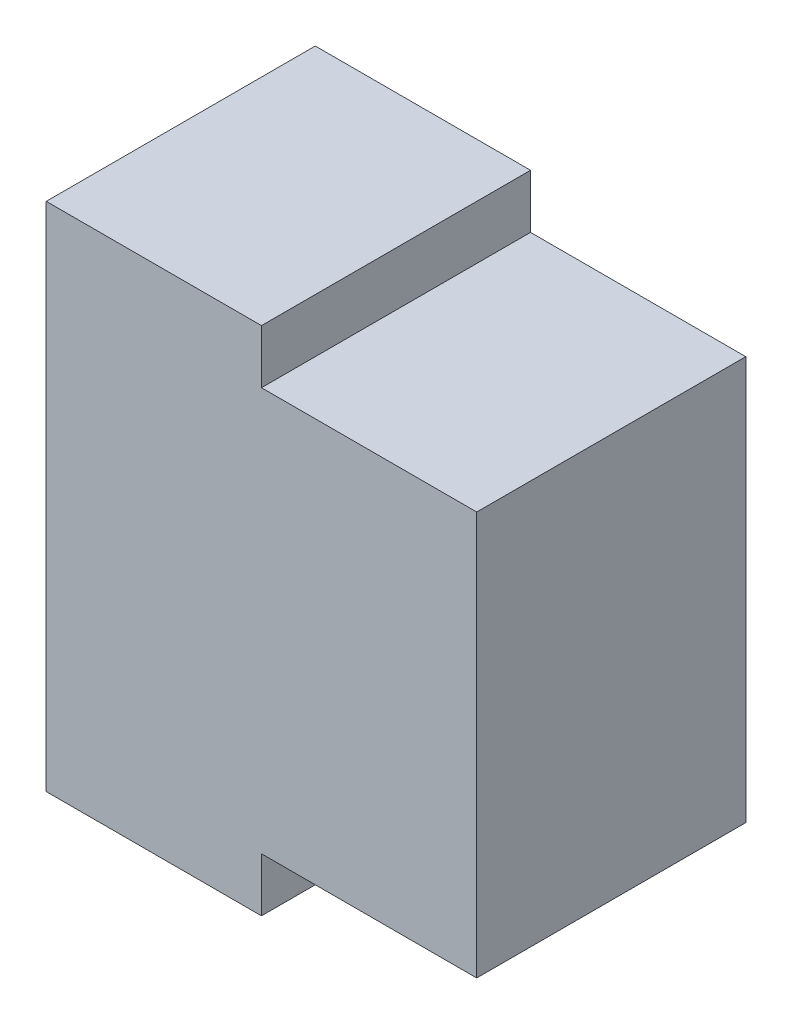
ISO-10303-21;
HEADER;
FILE_DESCRIPTION(('STEP AP214'),'2;1');
FILE_NAME('part.step','',(''),(''),'','','');
FILE_SCHEMA(('AUTOMOTIVE_DESIGN { 1 0 10303 214 1 1 1 1 }'));
ENDSEC;
DATA;
#1=APPLICATION_CONTEXT('core data for automotive mechanical design processes');
#2=APPLICATION_PROTOCOL_DEFINITION('international standard','automotive_design',2000,#1);
#3=PRODUCT_CONTEXT('',#1,'mechanical');
#4=PRODUCT('Part','Part','',(#3));
#5=PRODUCT_RELATED_PRODUCT_CATEGORY('part','',(#4));
#6=PRODUCT_DEFINITION_FORMATION('','',#4);
#7=PRODUCT_DEFINITION_CONTEXT('part definition',#1,'design');
#8=PRODUCT_DEFINITION('design','',#6,#7);
#9=PRODUCT_DEFINITION_SHAPE('','',#8);
#10=(LENGTH_UNIT() NAMED_UNIT(*) SI_UNIT(.MILLI.,.METRE.));
#11=(NAMED_UNIT(*) PLANE_ANGLE_UNIT() SI_UNIT($,.RADIAN.));
#12=(NAMED_UNIT(*) SI_UNIT($,.STERADIAN.) SOLID_ANGLE_UNIT());
#13=UNCERTAINTY_MEASURE_WITH_UNIT(LENGTH_MEASURE(1.E-05),#10,'distance_accuracy_value','');
#14=(GEOMETRIC_REPRESENTATION_CONTEXT(3) GLOBAL_UNCERTAINTY_ASSIGNED_CONTEXT((#13)) GLOBAL_UNIT_ASSIGNED_CONTEXT((#10,
#11,#12)) REPRESENTATION_CONTEXT('',''));
#15=CARTESIAN_POINT('',(0.,0.,0.));
#16=DIRECTION('',(0.,0.,1.));
#17=DIRECTION('',(1.,0.,0.));
#18=AXIS2_PLACEMENT_3D('',#15,#16,#17);
#19=CARTESIAN_POINT('',(-2.66142857142855,0.,0.925));
#20=DIRECTION('',(0.,0.,1.));
#21=DIRECTION('',(1.,0.,0.));
#22=AXIS2_PLACEMENT_3D('',#19,#20,#21);
#23=PLANE('',#22);
#24=DIRECTION('',(0.,-1.,0.));
#25=VECTOR('',#24,1.);
#26=CARTESIAN_POINT('',(-3.03,0.475000000000082,0.925));
#27=LINE('',#26,#25);
#28=CARTESIAN_POINT('',(-3.03,0.475000000000082,0.925));
#29=VERTEX_POINT('',#28);
#30=CARTESIAN_POINT('',(-3.03,-0.475000000000021,0.925));
#31=VERTEX_POINT('',#30);
#32=EDGE_CURVE('E25',#29,#31,#27,.T.);
#33=ORIENTED_EDGE('',*,*,#32,.F.);
#34=DIRECTION('',(-1.,0.,0.));
#35=VECTOR('',#34,1.);
#36=CARTESIAN_POINT('',(-2.78,0.475000000000081,0.925));
#37=LINE('',#36,#35);
#38=CARTESIAN_POINT('',(-2.63,0.475000000000081,0.925));
#39=VERTEX_POINT('',#38);
#40=EDGE_CURVE('E296',#39,#29,#37,.T.);
#41=ORIENTED_EDGE('',*,*,#40,.F.);
#42=DIRECTION('',(0.,1.,0.));
#43=VECTOR('',#42,1.);
#44=CARTESIAN_POINT('',(-2.63,0.375,0.925));
#45=LINE('',#44,#43);
#46=CARTESIAN_POINT('',(-2.63,0.375,0.925));
#47=VERTEX_POINT('',#46);
#48=EDGE_CURVE('E266',#47,#39,#45,.T.);
#49=ORIENTED_EDGE('',*,*,#48,.F.);
#50=DIRECTION('',(-1.,0.,0.));
#51=VECTOR('',#50,1.);
#52=CARTESIAN_POINT('',(-2.22999999999996,0.375,0.925));
#53=LINE('',#52,#51);
#54=CARTESIAN_POINT('',(-2.22999999999996,0.375,0.925));
#55=VERTEX_POINT('',#54);
#56=EDGE_CURVE('E140',#55,#47,#53,.T.);
#57=ORIENTED_EDGE('',*,*,#56,.F.);
#58=DIRECTION('',(0.,1.,0.));
#59=VECTOR('',#58,1.);
#60=CARTESIAN_POINT('',(-2.22999999999996,-0.375,0.925));
#61=LINE('',#60,#59);
#62=CARTESIAN_POINT('',(-2.22999999999996,-0.375,0.925));
#63=VERTEX_POINT('',#62);
#64=EDGE_CURVE('E134',#63,#55,#61,.T.);
#65=ORIENTED_EDGE('',*,*,#64,.F.);
#66=DIRECTION('',(1.,0.,0.));
#67=VECTOR('',#66,1.);
#68=CARTESIAN_POINT('',(-2.78,-0.375,0.925));
#69=LINE('',#68,#67);
#70=CARTESIAN_POINT('',(-2.63,-0.375,0.925));
#71=VERTEX_POINT('',#70);
#72=EDGE_CURVE('E121',#71,#63,#69,.T.);
#73=ORIENTED_EDGE('',*,*,#72,.F.);
#74=DIRECTION('',(0.,1.,0.));
#75=VECTOR('',#74,1.);
#76=CARTESIAN_POINT('',(-2.63,0.375,0.925));
#77=LINE('',#76,#75);
#78=CARTESIAN_POINT('',(-2.63,-0.475000000000021,0.925));
#79=VERTEX_POINT('',#78);
#80=EDGE_CURVE('E78',#79,#71,#77,.T.);
#81=ORIENTED_EDGE('',*,*,#80,.F.);
#82=DIRECTION('',(1.,0.,0.));
#83=VECTOR('',#82,1.);
#84=CARTESIAN_POINT('',(-3.03,-0.475000000000021,0.925));
#85=LINE('',#84,#83);
#86=EDGE_CURVE('E165',#31,#79,#85,.T.);
#87=ORIENTED_EDGE('',*,*,#86,.F.);
#88=EDGE_LOOP('',(#33,#41,#49,#57,#65,#73,#81,#87));
#89=FACE_BOUND('',#88,.T.);
#90=ADVANCED_FACE('F17',(#89),#23,.F.);
#91=CARTESIAN_POINT('',(-2.66142857142855,0.,1.425));
#92=DIRECTION('',(0.,0.,1.));
#93=DIRECTION('',(1.,0.,0.));
#94=AXIS2_PLACEMENT_3D('',#91,#92,#93);
#95=PLANE('',#94);
#96=DIRECTION('',(0.,-1.,0.));
#97=VECTOR('',#96,1.);
#98=CARTESIAN_POINT('',(-3.03,0.475000000000082,1.425));
#99=LINE('',#98,#97);
#100=CARTESIAN_POINT('',(-3.03,0.475000000000082,1.425));
#101=VERTEX_POINT('',#100);
#102=CARTESIAN_POINT('',(-3.03,-0.475000000000021,1.425));
#103=VERTEX_POINT('',#102);
#104=EDGE_CURVE('E11',#101,#103,#99,.T.);
#105=ORIENTED_EDGE('',*,*,#104,.T.);
#106=DIRECTION('',(1.,0.,0.));
#107=VECTOR('',#106,1.);
#108=CARTESIAN_POINT('',(-3.03,-0.475000000000021,1.425));
#109=LINE('',#108,#107);
#110=CARTESIAN_POINT('',(-2.63,-0.475000000000021,1.425));
#111=VERTEX_POINT('',#110);
#112=EDGE_CURVE('E168',#103,#111,#109,.T.);
#113=ORIENTED_EDGE('',*,*,#112,.T.);
#114=DIRECTION('',(0.,1.,0.));
#115=VECTOR('',#114,1.);
#116=CARTESIAN_POINT('',(-2.63,0.,1.425));
#117=LINE('',#116,#115);
#118=CARTESIAN_POINT('',(-2.63,-0.375,1.425));
#119=VERTEX_POINT('',#118);
#120=EDGE_CURVE('E65',#111,#119,#117,.T.);
#121=ORIENTED_EDGE('',*,*,#120,.T.);
#122=DIRECTION('',(1.,0.,0.));
#123=VECTOR('',#122,1.);
#124=CARTESIAN_POINT('',(-2.78,-0.375,1.425));
#125=LINE('',#124,#123);
#126=CARTESIAN_POINT('',(-2.22999999999996,-0.375,1.425));
#127=VERTEX_POINT('',#126);
#128=EDGE_CURVE('E130',#119,#127,#125,.T.);
#129=ORIENTED_EDGE('',*,*,#128,.T.);
#130=DIRECTION('',(0.,1.,0.));
#131=VECTOR('',#130,1.);
#132=CARTESIAN_POINT('',(-2.22999999999996,-0.375,1.425));
#133=LINE('',#132,#131);
#134=CARTESIAN_POINT('',(-2.22999999999996,0.375,1.425));
#135=VERTEX_POINT('',#134);
#136=EDGE_CURVE('E113',#127,#135,#133,.T.);
#137=ORIENTED_EDGE('',*,*,#136,.T.);
#138=DIRECTION('',(-1.,0.,0.));
#139=VECTOR('',#138,1.);
#140=CARTESIAN_POINT('',(-2.22999999999996,0.375,1.425));
#141=LINE('',#140,#139);
#142=CARTESIAN_POINT('',(-2.63,0.375,1.425));
#143=VERTEX_POINT('',#142);
#144=EDGE_CURVE('E150',#135,#143,#141,.T.);
#145=ORIENTED_EDGE('',*,*,#144,.T.);
#146=DIRECTION('',(0.,1.,0.));
#147=VECTOR('',#146,1.);
#148=CARTESIAN_POINT('',(-2.63,0.375,1.425));
#149=LINE('',#148,#147);
#150=CARTESIAN_POINT('',(-2.63,0.475000000000081,1.425));
#151=VERTEX_POINT('',#150);
#152=EDGE_CURVE('E259',#143,#151,#149,.T.);
#153=ORIENTED_EDGE('',*,*,#152,.T.);
#154=DIRECTION('',(-1.,0.,0.));
#155=VECTOR('',#154,1.);
#156=CARTESIAN_POINT('',(-2.78,0.475000000000081,1.425));
#157=LINE('',#156,#155);
#158=EDGE_CURVE('E283',#151,#101,#157,.T.);
#159=ORIENTED_EDGE('',*,*,#158,.T.);
#160=EDGE_LOOP('',(#105,#113,#121,#129,#137,#145,#153,#159));
#161=FACE_BOUND('',#160,.T.);
#162=ADVANCED_FACE('F324',(#161),#95,.T.);
#163=CARTESIAN_POINT('',(-3.03,0.475000000000082,0.925));
#164=DIRECTION('',(-1.,0.,0.));
#165=DIRECTION('',(0.,1.,0.));
#166=AXIS2_PLACEMENT_3D('',#163,#164,#165);
#167=PLANE('',#166);
#168=ORIENTED_EDGE('',*,*,#32,.T.);
#169=DIRECTION('',(0.,0.,1.));
#170=VECTOR('',#169,1.);
#171=CARTESIAN_POINT('',(-3.03,-0.475000000000021,0.925));
#172=LINE('',#171,#170);
#173=EDGE_CURVE('E171',#31,#103,#172,.T.);
#174=ORIENTED_EDGE('',*,*,#173,.T.);
#175=ORIENTED_EDGE('',*,*,#104,.F.);
#176=DIRECTION('',(0.,0.,1.));
#177=VECTOR('',#176,1.);
#178=CARTESIAN_POINT('',(-3.03,0.475000000000082,0.925));
#179=LINE('',#178,#177);
#180=EDGE_CURVE('E289',#29,#101,#179,.T.);
#181=ORIENTED_EDGE('',*,*,#180,.F.);
#182=EDGE_LOOP('',(#168,#174,#175,#181));
#183=FACE_BOUND('',#182,.T.);
#184=ADVANCED_FACE('F322',(#183),#167,.T.);
#185=CARTESIAN_POINT('',(-3.03,-0.475000000000021,0.925));
#186=DIRECTION('',(0.,-1.,0.));
#187=DIRECTION('',(-1.,0.,0.));
#188=AXIS2_PLACEMENT_3D('',#185,#186,#187);
#189=PLANE('',#188);
#190=ORIENTED_EDGE('',*,*,#86,.T.);
#191=DIRECTION('',(0.,0.,1.));
#192=VECTOR('',#191,1.);
#193=CARTESIAN_POINT('',(-2.63,-0.475000000000021,0.925));
#194=LINE('',#193,#192);
#195=EDGE_CURVE('E161',#79,#111,#194,.T.);
#196=ORIENTED_EDGE('',*,*,#195,.T.);
#197=ORIENTED_EDGE('',*,*,#112,.F.);
#198=ORIENTED_EDGE('',*,*,#173,.F.);
#199=EDGE_LOOP('',(#190,#196,#197,#198));
#200=FACE_BOUND('',#199,.T.);
#201=ADVANCED_FACE('F349',(#200),#189,.T.);
#202=CARTESIAN_POINT('',(-2.63,0.375,0.925));
#203=DIRECTION('',(1.,0.,0.));
#204=DIRECTION('',(0.,-1.,0.));
#205=AXIS2_PLACEMENT_3D('',#202,#203,#204);
#206=PLANE('',#205);
#207=ORIENTED_EDGE('',*,*,#80,.T.);
#208=DIRECTION('',(0.,0.,1.));
#209=VECTOR('',#208,1.);
#210=CARTESIAN_POINT('',(-2.63,-0.375,0.925));
#211=LINE('',#210,#209);
#212=EDGE_CURVE('E126',#71,#119,#211,.T.);
#213=ORIENTED_EDGE('',*,*,#212,.T.);
#214=ORIENTED_EDGE('',*,*,#120,.F.);
#215=ORIENTED_EDGE('',*,*,#195,.F.);
#216=EDGE_LOOP('',(#207,#213,#214,#215));
#217=FACE_BOUND('',#216,.T.);
#218=ADVANCED_FACE('F353',(#217),#206,.T.);
#219=CARTESIAN_POINT('',(-2.78,-0.375,0.925));
#220=DIRECTION('',(0.,-1.,0.));
#221=DIRECTION('',(-1.,0.,0.));
#222=AXIS2_PLACEMENT_3D('',#219,#220,#221);
#223=PLANE('',#222);
#224=ORIENTED_EDGE('',*,*,#72,.T.);
#225=DIRECTION('',(0.,0.,1.));
#226=VECTOR('',#225,1.);
#227=CARTESIAN_POINT('',(-2.22999999999996,-0.375,0.925));
#228=LINE('',#227,#226);
#229=EDGE_CURVE('E125',#63,#127,#228,.T.);
#230=ORIENTED_EDGE('',*,*,#229,.T.);
#231=ORIENTED_EDGE('',*,*,#128,.F.);
#232=ORIENTED_EDGE('',*,*,#212,.F.);
#233=EDGE_LOOP('',(#224,#230,#231,#232));
#234=FACE_BOUND('',#233,.T.);
#235=ADVANCED_FACE('F123',(#234),#223,.T.);
#236=CARTESIAN_POINT('',(-2.22999999999996,-0.375,0.925));
#237=DIRECTION('',(1.,0.,0.));
#238=DIRECTION('',(0.,1.,0.));
#239=AXIS2_PLACEMENT_3D('',#236,#237,#238);
#240=PLANE('',#239);
#241=ORIENTED_EDGE('',*,*,#64,.T.);
#242=DIRECTION('',(0.,0.,1.));
#243=VECTOR('',#242,1.);
#244=CARTESIAN_POINT('',(-2.22999999999996,0.375,0.925));
#245=LINE('',#244,#243);
#246=EDGE_CURVE('E142',#55,#135,#245,.T.);
#247=ORIENTED_EDGE('',*,*,#246,.T.);
#248=ORIENTED_EDGE('',*,*,#136,.F.);
#249=ORIENTED_EDGE('',*,*,#229,.F.);
#250=EDGE_LOOP('',(#241,#247,#248,#249));
#251=FACE_BOUND('',#250,.T.);
#252=ADVANCED_FACE('F133',(#251),#240,.T.);
#253=CARTESIAN_POINT('',(-2.22999999999996,0.375,0.925));
#254=DIRECTION('',(0.,1.,0.));
#255=DIRECTION('',(1.,0.,0.));
#256=AXIS2_PLACEMENT_3D('',#253,#254,#255);
#257=PLANE('',#256);
#258=ORIENTED_EDGE('',*,*,#56,.T.);
#259=DIRECTION('',(0.,0.,1.));
#260=VECTOR('',#259,1.);
#261=CARTESIAN_POINT('',(-2.63,0.375,0.925));
#262=LINE('',#261,#260);
#263=EDGE_CURVE('E251',#47,#143,#262,.T.);
#264=ORIENTED_EDGE('',*,*,#263,.T.);
#265=ORIENTED_EDGE('',*,*,#144,.F.);
#266=ORIENTED_EDGE('',*,*,#246,.F.);
#267=EDGE_LOOP('',(#258,#264,#265,#266));
#268=FACE_BOUND('',#267,.T.);
#269=ADVANCED_FACE('F331',(#268),#257,.T.);
#270=CARTESIAN_POINT('',(-2.63,0.375,0.925));
#271=DIRECTION('',(1.,0.,0.));
#272=DIRECTION('',(0.,-1.,0.));
#273=AXIS2_PLACEMENT_3D('',#270,#271,#272);
#274=PLANE('',#273);
#275=ORIENTED_EDGE('',*,*,#48,.T.);
#276=DIRECTION('',(0.,0.,1.));
#277=VECTOR('',#276,1.);
#278=CARTESIAN_POINT('',(-2.63,0.475000000000081,0.925));
#279=LINE('',#278,#277);
#280=EDGE_CURVE('E274',#39,#151,#279,.T.);
#281=ORIENTED_EDGE('',*,*,#280,.T.);
#282=ORIENTED_EDGE('',*,*,#152,.F.);
#283=ORIENTED_EDGE('',*,*,#263,.F.);
#284=EDGE_LOOP('',(#275,#281,#282,#283));
#285=FACE_BOUND('',#284,.T.);
#286=ADVANCED_FACE('F329',(#285),#274,.T.);
#287=CARTESIAN_POINT('',(-2.78,0.475000000000081,0.925));
#288=DIRECTION('',(0.,1.,0.));
#289=DIRECTION('',(1.,0.,0.));
#290=AXIS2_PLACEMENT_3D('',#287,#288,#289);
#291=PLANE('',#290);
#292=ORIENTED_EDGE('',*,*,#40,.T.);
#293=ORIENTED_EDGE('',*,*,#180,.T.);
#294=ORIENTED_EDGE('',*,*,#158,.F.);
#295=ORIENTED_EDGE('',*,*,#280,.F.);
#296=EDGE_LOOP('',(#292,#293,#294,#295));
#297=FACE_BOUND('',#296,.T.);
#298=ADVANCED_FACE('F319',(#297),#291,.T.);
#299=CLOSED_SHELL('',(#90,#162,#184,#201,#218,#235,#252,#269,#286,#298));
#300=MANIFOLD_SOLID_BREP('B1',#299);
#301=ADVANCED_BREP_SHAPE_REPRESENTATION('',(#18,#300),#14);
#302=SHAPE_DEFINITION_REPRESENTATION(#9,#301);
ENDSEC;
END-ISO-10303-21;
